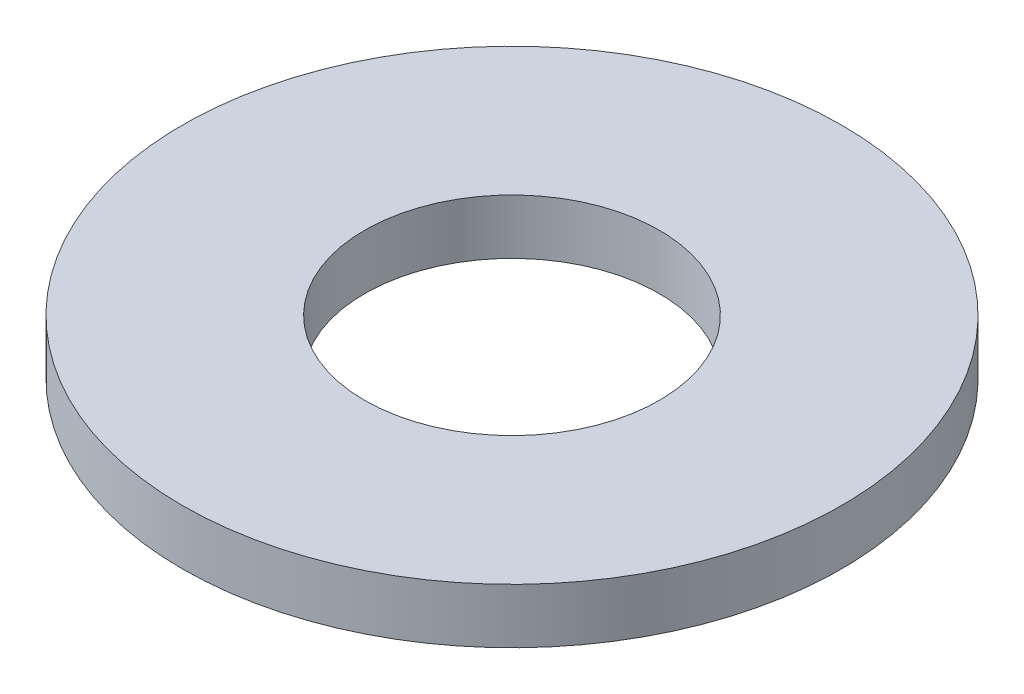
ISO-10303-21;
HEADER;
FILE_DESCRIPTION(('STEP AP214'),'2;1');
FILE_NAME('part.step','',(''),(''),'','','');
FILE_SCHEMA(('AUTOMOTIVE_DESIGN { 1 0 10303 214 1 1 1 1 }'));
ENDSEC;
DATA;
#1=APPLICATION_CONTEXT('core data for automotive mechanical design processes');
#2=APPLICATION_PROTOCOL_DEFINITION('international standard','automotive_design',2000,#1);
#3=PRODUCT_CONTEXT('',#1,'mechanical');
#4=PRODUCT('Part','Part','',(#3));
#5=PRODUCT_RELATED_PRODUCT_CATEGORY('part','',(#4));
#6=PRODUCT_DEFINITION_FORMATION('','',#4);
#7=PRODUCT_DEFINITION_CONTEXT('part definition',#1,'design');
#8=PRODUCT_DEFINITION('design','',#6,#7);
#9=PRODUCT_DEFINITION_SHAPE('','',#8);
#10=(LENGTH_UNIT() NAMED_UNIT(*) SI_UNIT(.MILLI.,.METRE.));
#11=(NAMED_UNIT(*) PLANE_ANGLE_UNIT() SI_UNIT($,.RADIAN.));
#12=(NAMED_UNIT(*) SI_UNIT($,.STERADIAN.) SOLID_ANGLE_UNIT());
#13=UNCERTAINTY_MEASURE_WITH_UNIT(LENGTH_MEASURE(1.E-05),#10,'distance_accuracy_value','');
#14=(GEOMETRIC_REPRESENTATION_CONTEXT(3) GLOBAL_UNCERTAINTY_ASSIGNED_CONTEXT((#13)) GLOBAL_UNIT_ASSIGNED_CONTEXT((#10,
#11,#12)) REPRESENTATION_CONTEXT('',''));
#15=CARTESIAN_POINT('',(0.,0.,0.));
#16=DIRECTION('',(0.,0.,1.));
#17=DIRECTION('',(1.,0.,0.));
#18=AXIS2_PLACEMENT_3D('',#15,#16,#17);
#19=CARTESIAN_POINT('',(0.,1.5,0.));
#20=DIRECTION('',(0.,1.,0.));
#21=DIRECTION('',(0.,0.,1.));
#22=AXIS2_PLACEMENT_3D('',#19,#20,#21);
#23=PLANE('',#22);
#24=CARTESIAN_POINT('',(0.,1.5,0.));
#25=DIRECTION('',(0.,1.,0.));
#26=DIRECTION('',(0.,0.,1.));
#27=AXIS2_PLACEMENT_3D('',#24,#25,#26);
#28=CIRCLE('',#27,9.);
#29=CARTESIAN_POINT('',(0.,1.5,9.));
#30=VERTEX_POINT('',#29);
#31=EDGE_CURVE('E10',#30,#30,#28,.T.);
#32=ORIENTED_EDGE('',*,*,#31,.T.);
#33=EDGE_LOOP('',(#32));
#34=FACE_BOUND('',#33,.T.);
#35=CARTESIAN_POINT('',(0.,1.5,0.));
#36=DIRECTION('',(0.,1.,0.));
#37=DIRECTION('',(0.,0.,1.));
#38=AXIS2_PLACEMENT_3D('',#35,#36,#37);
#39=CIRCLE('',#38,4.025);
#40=CARTESIAN_POINT('',(0.,1.5,4.025));
#41=VERTEX_POINT('',#40);
#42=EDGE_CURVE('E56',#41,#41,#39,.T.);
#43=ORIENTED_EDGE('',*,*,#42,.F.);
#44=EDGE_LOOP('',(#43));
#45=FACE_BOUND('',#44,.T.);
#46=ADVANCED_FACE('F43',(#34,#45),#23,.T.);
#47=CARTESIAN_POINT('',(0.,0.,0.));
#48=DIRECTION('',(0.,1.,0.));
#49=DIRECTION('',(0.,0.,1.));
#50=AXIS2_PLACEMENT_3D('',#47,#48,#49);
#51=PLANE('',#50);
#52=CARTESIAN_POINT('',(0.,0.,0.));
#53=DIRECTION('',(0.,1.,0.));
#54=DIRECTION('',(0.,0.,1.));
#55=AXIS2_PLACEMENT_3D('',#52,#53,#54);
#56=CIRCLE('',#55,9.);
#57=CARTESIAN_POINT('',(0.,0.,9.));
#58=VERTEX_POINT('',#57);
#59=EDGE_CURVE('E47',#58,#58,#56,.T.);
#60=ORIENTED_EDGE('',*,*,#59,.F.);
#61=EDGE_LOOP('',(#60));
#62=FACE_BOUND('',#61,.T.);
#63=CARTESIAN_POINT('',(0.,0.,0.));
#64=DIRECTION('',(0.,1.,0.));
#65=DIRECTION('',(0.,0.,1.));
#66=AXIS2_PLACEMENT_3D('',#63,#64,#65);
#67=CIRCLE('',#66,4.025);
#68=CARTESIAN_POINT('',(0.,0.,4.025));
#69=VERTEX_POINT('',#68);
#70=EDGE_CURVE('E58',#69,#69,#67,.T.);
#71=ORIENTED_EDGE('',*,*,#70,.T.);
#72=EDGE_LOOP('',(#71));
#73=FACE_BOUND('',#72,.T.);
#74=ADVANCED_FACE('F70',(#62,#73),#51,.F.);
#75=CARTESIAN_POINT('',(0.,1.5,0.));
#76=DIRECTION('',(0.,-1.,0.));
#77=DIRECTION('',(0.,0.,-1.));
#78=AXIS2_PLACEMENT_3D('',#75,#76,#77);
#79=CYLINDRICAL_SURFACE('',#78,9.);
#80=ORIENTED_EDGE('',*,*,#31,.F.);
#81=EDGE_LOOP('',(#80));
#82=FACE_BOUND('',#81,.T.);
#83=ORIENTED_EDGE('',*,*,#59,.T.);
#84=EDGE_LOOP('',(#83));
#85=FACE_BOUND('',#84,.T.);
#86=ADVANCED_FACE('F45',(#82,#85),#79,.T.);
#87=CARTESIAN_POINT('',(0.,1.5,0.));
#88=DIRECTION('',(0.,-1.,0.));
#89=DIRECTION('',(0.,0.,-1.));
#90=AXIS2_PLACEMENT_3D('',#87,#88,#89);
#91=CYLINDRICAL_SURFACE('',#90,4.025);
#92=ORIENTED_EDGE('',*,*,#42,.T.);
#93=EDGE_LOOP('',(#92));
#94=FACE_BOUND('',#93,.T.);
#95=ORIENTED_EDGE('',*,*,#70,.F.);
#96=EDGE_LOOP('',(#95));
#97=FACE_BOUND('',#96,.T.);
#98=ADVANCED_FACE('F66',(#94,#97),#91,.F.);
#99=CLOSED_SHELL('',(#46,#74,#86,#98));
#100=MANIFOLD_SOLID_BREP('B2',#99);
#101=ADVANCED_BREP_SHAPE_REPRESENTATION('',(#18,#100),#14);
#102=SHAPE_DEFINITION_REPRESENTATION(#9,#101);
ENDSEC;
END-ISO-10303-21;
